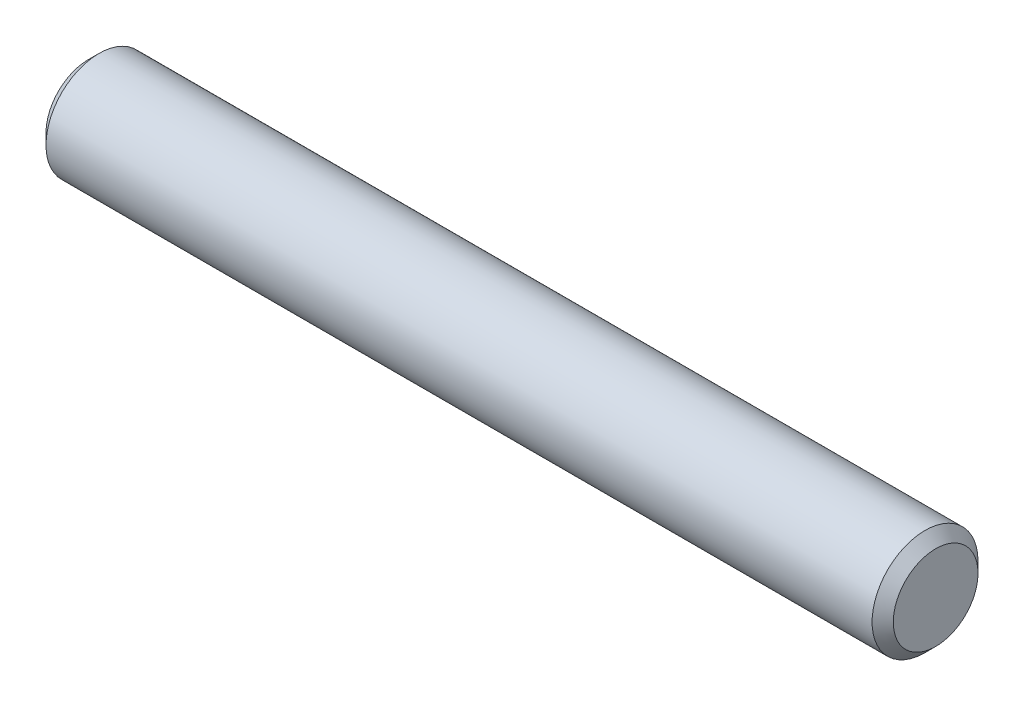
ISO-10303-21;
HEADER;
FILE_DESCRIPTION(('STEP AP214'),'2;1');
FILE_NAME('part.step','',(''),(''),'','','');
FILE_SCHEMA(('AUTOMOTIVE_DESIGN { 1 0 10303 214 1 1 1 1 }'));
ENDSEC;
DATA;
#1=APPLICATION_CONTEXT('core data for automotive mechanical design processes');
#2=APPLICATION_PROTOCOL_DEFINITION('international standard','automotive_design',2000,#1);
#3=PRODUCT_CONTEXT('',#1,'mechanical');
#4=PRODUCT('Part','Part','',(#3));
#5=PRODUCT_RELATED_PRODUCT_CATEGORY('part','',(#4));
#6=PRODUCT_DEFINITION_FORMATION('','',#4);
#7=PRODUCT_DEFINITION_CONTEXT('part definition',#1,'design');
#8=PRODUCT_DEFINITION('design','',#6,#7);
#9=PRODUCT_DEFINITION_SHAPE('','',#8);
#10=(LENGTH_UNIT() NAMED_UNIT(*) SI_UNIT(.MILLI.,.METRE.));
#11=(NAMED_UNIT(*) PLANE_ANGLE_UNIT() SI_UNIT($,.RADIAN.));
#12=(NAMED_UNIT(*) SI_UNIT($,.STERADIAN.) SOLID_ANGLE_UNIT());
#13=UNCERTAINTY_MEASURE_WITH_UNIT(LENGTH_MEASURE(1.E-05),#10,'distance_accuracy_value','');
#14=(GEOMETRIC_REPRESENTATION_CONTEXT(3) GLOBAL_UNCERTAINTY_ASSIGNED_CONTEXT((#13)) GLOBAL_UNIT_ASSIGNED_CONTEXT((#10,
#11,#12)) REPRESENTATION_CONTEXT('',''));
#15=CARTESIAN_POINT('',(0.,0.,0.));
#16=DIRECTION('',(0.,0.,1.));
#17=DIRECTION('',(1.,0.,0.));
#18=AXIS2_PLACEMENT_3D('',#15,#16,#17);
#19=CARTESIAN_POINT('',(-12.7,0.,0.));
#20=DIRECTION('',(1.,0.,0.));
#21=DIRECTION('',(0.,0.,-1.));
#22=AXIS2_PLACEMENT_3D('',#19,#20,#21);
#23=CYLINDRICAL_SURFACE('',#22,1.5875);
#24=CARTESIAN_POINT('',(12.3825,0.,0.));
#25=DIRECTION('',(1.,0.,0.));
#26=DIRECTION('',(0.,0.,-1.));
#27=AXIS2_PLACEMENT_3D('',#24,#25,#26);
#28=CIRCLE('',#27,1.5875);
#29=CARTESIAN_POINT('',(12.3825,0.,-1.5875));
#30=VERTEX_POINT('',#29);
#31=EDGE_CURVE('E37',#30,#30,#28,.F.);
#32=ORIENTED_EDGE('',*,*,#31,.T.);
#33=EDGE_LOOP('',(#32));
#34=FACE_BOUND('',#33,.T.);
#35=CARTESIAN_POINT('',(-12.3825,0.,0.));
#36=DIRECTION('',(1.,0.,0.));
#37=DIRECTION('',(0.,0.,-1.));
#38=AXIS2_PLACEMENT_3D('',#35,#36,#37);
#39=CIRCLE('',#38,1.5875);
#40=CARTESIAN_POINT('',(-12.3825,0.,-1.5875));
#41=VERTEX_POINT('',#40);
#42=EDGE_CURVE('E41',#41,#41,#39,.T.);
#43=ORIENTED_EDGE('',*,*,#42,.T.);
#44=EDGE_LOOP('',(#43));
#45=FACE_BOUND('',#44,.T.);
#46=ADVANCED_FACE('F30',(#34,#45),#23,.T.);
#47=CARTESIAN_POINT('',(-12.7,0.,0.));
#48=DIRECTION('',(1.,0.,0.));
#49=DIRECTION('',(0.,0.,-1.));
#50=AXIS2_PLACEMENT_3D('',#47,#48,#49);
#51=PLANE('',#50);
#52=CARTESIAN_POINT('',(-12.7,0.,0.));
#53=DIRECTION('',(1.,0.,0.));
#54=DIRECTION('',(0.,0.,-1.));
#55=AXIS2_PLACEMENT_3D('',#52,#53,#54);
#56=CIRCLE('',#55,1.26999999999999);
#57=CARTESIAN_POINT('',(-12.7,0.,-1.26999999999999));
#58=VERTEX_POINT('',#57);
#59=EDGE_CURVE('E10',#58,#58,#56,.F.);
#60=ORIENTED_EDGE('',*,*,#59,.T.);
#61=EDGE_LOOP('',(#60));
#62=FACE_BOUND('',#61,.T.);
#63=ADVANCED_FACE('F61',(#62),#51,.F.);
#64=CARTESIAN_POINT('',(12.7,0.,0.));
#65=DIRECTION('',(1.,0.,0.));
#66=DIRECTION('',(0.,0.,-1.));
#67=AXIS2_PLACEMENT_3D('',#64,#65,#66);
#68=PLANE('',#67);
#69=CARTESIAN_POINT('',(12.7,0.,0.));
#70=DIRECTION('',(1.,0.,0.));
#71=DIRECTION('',(0.,0.,-1.));
#72=AXIS2_PLACEMENT_3D('',#69,#70,#71);
#73=CIRCLE('',#72,1.27);
#74=CARTESIAN_POINT('',(12.7,0.,-1.27));
#75=VERTEX_POINT('',#74);
#76=EDGE_CURVE('E45',#75,#75,#73,.T.);
#77=ORIENTED_EDGE('',*,*,#76,.T.);
#78=EDGE_LOOP('',(#77));
#79=FACE_BOUND('',#78,.T.);
#80=ADVANCED_FACE('F51',(#79),#68,.T.);
#81=CARTESIAN_POINT('',(12.7,0.,0.));
#82=DIRECTION('',(-1.,0.,0.));
#83=DIRECTION('',(0.,0.,1.));
#84=AXIS2_PLACEMENT_3D('',#81,#82,#83);
#85=CONICAL_SURFACE('',#84,1.27,0.78539816339745);
#86=ORIENTED_EDGE('',*,*,#31,.F.);
#87=EDGE_LOOP('',(#86));
#88=FACE_BOUND('',#87,.T.);
#89=ORIENTED_EDGE('',*,*,#76,.F.);
#90=EDGE_LOOP('',(#89));
#91=FACE_BOUND('',#90,.T.);
#92=ADVANCED_FACE('F53',(#88,#91),#85,.T.);
#93=CARTESIAN_POINT('',(-12.3825,0.,0.));
#94=DIRECTION('',(1.,0.,0.));
#95=DIRECTION('',(0.,0.,-1.));
#96=AXIS2_PLACEMENT_3D('',#93,#94,#95);
#97=CONICAL_SURFACE('',#96,1.5875,0.78539816339745);
#98=ORIENTED_EDGE('',*,*,#59,.F.);
#99=EDGE_LOOP('',(#98));
#100=FACE_BOUND('',#99,.T.);
#101=ORIENTED_EDGE('',*,*,#42,.F.);
#102=EDGE_LOOP('',(#101));
#103=FACE_BOUND('',#102,.T.);
#104=ADVANCED_FACE('F32',(#100,#103),#97,.T.);
#105=CLOSED_SHELL('',(#46,#63,#80,#92,#104));
#106=MANIFOLD_SOLID_BREP('B2',#105);
#107=ADVANCED_BREP_SHAPE_REPRESENTATION('',(#18,#106),#14);
#108=SHAPE_DEFINITION_REPRESENTATION(#9,#107);
ENDSEC;
END-ISO-10303-21;
